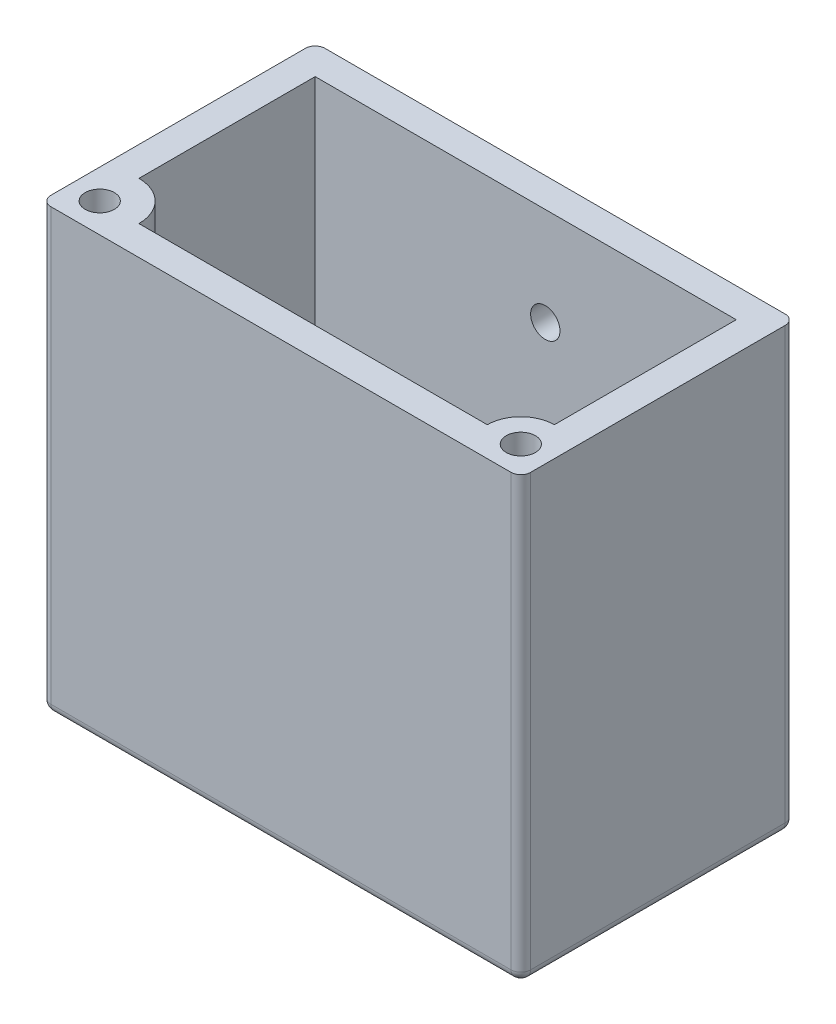
ISO-10303-21;
HEADER;
FILE_DESCRIPTION(('STEP AP214'),'2;1');
FILE_NAME('part.step','',(''),(''),'','','');
FILE_SCHEMA(('AUTOMOTIVE_DESIGN { 1 0 10303 214 1 1 1 1 }'));
ENDSEC;
DATA;
#1=APPLICATION_CONTEXT('core data for automotive mechanical design processes');
#2=APPLICATION_PROTOCOL_DEFINITION('international standard','automotive_design',2000,#1);
#3=PRODUCT_CONTEXT('',#1,'mechanical');
#4=PRODUCT('Part','Part','',(#3));
#5=PRODUCT_RELATED_PRODUCT_CATEGORY('part','',(#4));
#6=PRODUCT_DEFINITION_FORMATION('','',#4);
#7=PRODUCT_DEFINITION_CONTEXT('part definition',#1,'design');
#8=PRODUCT_DEFINITION('design','',#6,#7);
#9=PRODUCT_DEFINITION_SHAPE('','',#8);
#10=(LENGTH_UNIT() NAMED_UNIT(*) SI_UNIT(.MILLI.,.METRE.));
#11=(NAMED_UNIT(*) PLANE_ANGLE_UNIT() SI_UNIT($,.RADIAN.));
#12=(NAMED_UNIT(*) SI_UNIT($,.STERADIAN.) SOLID_ANGLE_UNIT());
#13=UNCERTAINTY_MEASURE_WITH_UNIT(LENGTH_MEASURE(1.E-05),#10,'distance_accuracy_value','');
#14=(GEOMETRIC_REPRESENTATION_CONTEXT(3) GLOBAL_UNCERTAINTY_ASSIGNED_CONTEXT((#13)) GLOBAL_UNIT_ASSIGNED_CONTEXT((#10,
#11,#12)) REPRESENTATION_CONTEXT('',''));
#15=CARTESIAN_POINT('',(0.,0.,0.));
#16=DIRECTION('',(0.,0.,1.));
#17=DIRECTION('',(1.,0.,0.));
#18=AXIS2_PLACEMENT_3D('',#15,#16,#17);
#19=CARTESIAN_POINT('',(-29.4867256637168,45.,-17.2212389380531));
#20=DIRECTION('',(1.,0.,0.));
#21=DIRECTION('',(0.,0.,-1.));
#22=AXIS2_PLACEMENT_3D('',#19,#20,#21);
#23=PLANE('',#22);
#24=DIRECTION('',(0.,0.,1.));
#25=VECTOR('',#24,1.);
#26=CARTESIAN_POINT('',(-29.4867256637168,45.,-17.2212389380531));
#27=LINE('',#26,#25);
#28=CARTESIAN_POINT('',(-29.4867256637168,45.,-16.2212389380531));
#29=VERTEX_POINT('',#28);
#30=CARTESIAN_POINT('',(-29.4867256637168,45.,9.7787610619469));
#31=VERTEX_POINT('',#30);
#32=EDGE_CURVE('E352',#29,#31,#27,.T.);
#33=ORIENTED_EDGE('',*,*,#32,.F.);
#34=DIRECTION('',(0.,-1.,0.));
#35=VECTOR('',#34,1.);
#36=CARTESIAN_POINT('',(-29.4867256637168,45.,-16.2212389380531));
#37=LINE('',#36,#35);
#38=CARTESIAN_POINT('',(-29.4867256637168,1.,-16.2212389380531));
#39=VERTEX_POINT('',#38);
#40=EDGE_CURVE('E237',#29,#39,#37,.T.);
#41=ORIENTED_EDGE('',*,*,#40,.T.);
#42=DIRECTION('',(0.,0.,1.));
#43=VECTOR('',#42,1.);
#44=CARTESIAN_POINT('',(-29.4867256637168,1.,-17.2212389380531));
#45=LINE('',#44,#43);
#46=CARTESIAN_POINT('',(-29.4867256637168,1.,9.77876106194691));
#47=VERTEX_POINT('',#46);
#48=EDGE_CURVE('E235',#39,#47,#45,.T.);
#49=ORIENTED_EDGE('',*,*,#48,.T.);
#50=DIRECTION('',(0.,-1.,0.));
#51=VECTOR('',#50,1.);
#52=CARTESIAN_POINT('',(-29.4867256637168,45.,9.77876106194691));
#53=LINE('',#52,#51);
#54=EDGE_CURVE('E233',#47,#31,#53,.F.);
#55=ORIENTED_EDGE('',*,*,#54,.T.);
#56=EDGE_LOOP('',(#33,#41,#49,#55));
#57=FACE_BOUND('',#56,.T.);
#58=ADVANCED_FACE('F34',(#57),#23,.F.);
#59=CARTESIAN_POINT('',(-29.4867256637168,45.,10.7787610619469));
#60=DIRECTION('',(0.,0.,-1.));
#61=DIRECTION('',(-1.,0.,0.));
#62=AXIS2_PLACEMENT_3D('',#59,#60,#61);
#63=PLANE('',#62);
#64=DIRECTION('',(1.,0.,0.));
#65=VECTOR('',#64,1.);
#66=CARTESIAN_POINT('',(-29.4867256637168,1.,10.7787610619469));
#67=LINE('',#66,#65);
#68=CARTESIAN_POINT('',(-28.4867256637168,1.,10.7787610619469));
#69=VERTEX_POINT('',#68);
#70=CARTESIAN_POINT('',(18.5132743362832,1.,10.7787610619469));
#71=VERTEX_POINT('',#70);
#72=EDGE_CURVE('E50',#69,#71,#67,.T.);
#73=ORIENTED_EDGE('',*,*,#72,.T.);
#74=DIRECTION('',(0.,-1.,0.));
#75=VECTOR('',#74,1.);
#76=CARTESIAN_POINT('',(18.5132743362832,45.,10.7787610619469));
#77=LINE('',#76,#75);
#78=CARTESIAN_POINT('',(18.5132743362832,45.,10.7787610619469));
#79=VERTEX_POINT('',#78);
#80=EDGE_CURVE('E11',#71,#79,#77,.F.);
#81=ORIENTED_EDGE('',*,*,#80,.T.);
#82=DIRECTION('',(1.,0.,0.));
#83=VECTOR('',#82,1.);
#84=CARTESIAN_POINT('',(-29.4867256637168,45.,10.7787610619469));
#85=LINE('',#84,#83);
#86=CARTESIAN_POINT('',(-28.4867256637168,45.,10.7787610619469));
#87=VERTEX_POINT('',#86);
#88=EDGE_CURVE('E357',#87,#79,#85,.T.);
#89=ORIENTED_EDGE('',*,*,#88,.F.);
#90=DIRECTION('',(0.,-1.,0.));
#91=VECTOR('',#90,1.);
#92=CARTESIAN_POINT('',(-28.4867256637168,45.,10.7787610619469));
#93=LINE('',#92,#91);
#94=EDGE_CURVE('E43',#87,#69,#93,.T.);
#95=ORIENTED_EDGE('',*,*,#94,.T.);
#96=EDGE_LOOP('',(#73,#81,#89,#95));
#97=FACE_BOUND('',#96,.T.);
#98=ADVANCED_FACE('F407',(#97),#63,.F.);
#99=CARTESIAN_POINT('',(19.5132743362832,45.,-17.2212389380531));
#100=DIRECTION('',(-1.,0.,0.));
#101=DIRECTION('',(0.,0.,1.));
#102=AXIS2_PLACEMENT_3D('',#99,#100,#101);
#103=PLANE('',#102);
#104=DIRECTION('',(0.,0.,-1.));
#105=VECTOR('',#104,1.);
#106=CARTESIAN_POINT('',(19.5132743362832,1.,-17.2212389380531));
#107=LINE('',#106,#105);
#108=CARTESIAN_POINT('',(19.5132743362832,1.,9.77876106194691));
#109=VERTEX_POINT('',#108);
#110=CARTESIAN_POINT('',(19.5132743362832,1.,-16.2212389380531));
#111=VERTEX_POINT('',#110);
#112=EDGE_CURVE('E199',#109,#111,#107,.T.);
#113=ORIENTED_EDGE('',*,*,#112,.T.);
#114=DIRECTION('',(0.,-1.,0.));
#115=VECTOR('',#114,1.);
#116=CARTESIAN_POINT('',(19.5132743362832,45.,-16.2212389380531));
#117=LINE('',#116,#115);
#118=CARTESIAN_POINT('',(19.5132743362832,45.,-16.2212389380531));
#119=VERTEX_POINT('',#118);
#120=EDGE_CURVE('E208',#111,#119,#117,.F.);
#121=ORIENTED_EDGE('',*,*,#120,.T.);
#122=DIRECTION('',(0.,0.,-1.));
#123=VECTOR('',#122,1.);
#124=CARTESIAN_POINT('',(19.5132743362832,45.,-17.2212389380531));
#125=LINE('',#124,#123);
#126=CARTESIAN_POINT('',(19.5132743362832,45.,9.77876106194691));
#127=VERTEX_POINT('',#126);
#128=EDGE_CURVE('E360',#127,#119,#125,.T.);
#129=ORIENTED_EDGE('',*,*,#128,.F.);
#130=DIRECTION('',(0.,-1.,0.));
#131=VECTOR('',#130,1.);
#132=CARTESIAN_POINT('',(19.5132743362832,45.,9.77876106194691));
#133=LINE('',#132,#131);
#134=EDGE_CURVE('E196',#127,#109,#133,.T.);
#135=ORIENTED_EDGE('',*,*,#134,.T.);
#136=EDGE_LOOP('',(#113,#121,#129,#135));
#137=FACE_BOUND('',#136,.T.);
#138=ADVANCED_FACE('F412',(#137),#103,.F.);
#139=CARTESIAN_POINT('',(-29.4867256637168,45.,-17.2212389380531));
#140=DIRECTION('',(0.,0.,1.));
#141=DIRECTION('',(1.,0.,0.));
#142=AXIS2_PLACEMENT_3D('',#139,#140,#141);
#143=PLANE('',#142);
#144=CARTESIAN_POINT('',(-2.98672566371681,35.,-17.2212389380531));
#145=DIRECTION('',(0.,0.,1.));
#146=DIRECTION('',(1.,0.,0.));
#147=AXIS2_PLACEMENT_3D('',#144,#145,#146);
#148=CIRCLE('',#147,1.5);
#149=CARTESIAN_POINT('',(-1.48672566371681,35.,-17.2212389380531));
#150=VERTEX_POINT('',#149);
#151=EDGE_CURVE('E300',#150,#150,#148,.T.);
#152=ORIENTED_EDGE('',*,*,#151,.T.);
#153=EDGE_LOOP('',(#152));
#154=FACE_BOUND('',#153,.T.);
#155=DIRECTION('',(-1.,0.,0.));
#156=VECTOR('',#155,1.);
#157=CARTESIAN_POINT('',(-29.4867256637168,45.,-17.2212389380531));
#158=LINE('',#157,#156);
#159=CARTESIAN_POINT('',(18.5132743362832,45.,-17.2212389380531));
#160=VERTEX_POINT('',#159);
#161=CARTESIAN_POINT('',(-28.4867256637168,45.,-17.2212389380531));
#162=VERTEX_POINT('',#161);
#163=EDGE_CURVE('E202',#160,#162,#158,.T.);
#164=ORIENTED_EDGE('',*,*,#163,.F.);
#165=DIRECTION('',(0.,-1.,0.));
#166=VECTOR('',#165,1.);
#167=CARTESIAN_POINT('',(18.5132743362832,45.,-17.2212389380531));
#168=LINE('',#167,#166);
#169=CARTESIAN_POINT('',(18.5132743362832,1.,-17.2212389380531));
#170=VERTEX_POINT('',#169);
#171=EDGE_CURVE('E223',#160,#170,#168,.T.);
#172=ORIENTED_EDGE('',*,*,#171,.T.);
#173=DIRECTION('',(-1.,0.,0.));
#174=VECTOR('',#173,1.);
#175=CARTESIAN_POINT('',(-29.4867256637168,1.,-17.2212389380531));
#176=LINE('',#175,#174);
#177=CARTESIAN_POINT('',(-28.4867256637168,1.,-17.2212389380531));
#178=VERTEX_POINT('',#177);
#179=EDGE_CURVE('E221',#170,#178,#176,.T.);
#180=ORIENTED_EDGE('',*,*,#179,.T.);
#181=DIRECTION('',(0.,-1.,0.));
#182=VECTOR('',#181,1.);
#183=CARTESIAN_POINT('',(-28.4867256637168,45.,-17.2212389380531));
#184=LINE('',#183,#182);
#185=EDGE_CURVE('E219',#178,#162,#184,.F.);
#186=ORIENTED_EDGE('',*,*,#185,.T.);
#187=EDGE_LOOP('',(#164,#172,#180,#186));
#188=FACE_BOUND('',#187,.T.);
#189=ADVANCED_FACE('F537',(#154,#188),#143,.F.);
#190=CARTESIAN_POINT('',(0.,45.,0.));
#191=DIRECTION('',(0.,1.,0.));
#192=DIRECTION('',(0.,0.,1.));
#193=AXIS2_PLACEMENT_3D('',#190,#191,#192);
#194=PLANE('',#193);
#195=CARTESIAN_POINT('',(-26.4867256637168,45.,7.77876106194691));
#196=DIRECTION('',(0.,-1.,0.));
#197=DIRECTION('',(0.,0.,-1.));
#198=AXIS2_PLACEMENT_3D('',#195,#196,#197);
#199=CIRCLE('',#198,1.49);
#200=CARTESIAN_POINT('',(-26.4867256637168,45.,6.28876106194691));
#201=VERTEX_POINT('',#200);
#202=EDGE_CURVE('E276',#201,#201,#199,.T.);
#203=ORIENTED_EDGE('',*,*,#202,.T.);
#204=EDGE_LOOP('',(#203));
#205=FACE_BOUND('',#204,.T.);
#206=DIRECTION('',(1.,0.,0.));
#207=VECTOR('',#206,1.);
#208=CARTESIAN_POINT('',(16.5132743362832,45.,7.77876106194691));
#209=LINE('',#208,#207);
#210=CARTESIAN_POINT('',(-22.4867256637168,45.,7.77876106194691));
#211=VERTEX_POINT('',#210);
#212=CARTESIAN_POINT('',(13.0915061708648,45.,7.77876106194691));
#213=VERTEX_POINT('',#212);
#214=EDGE_CURVE('E340',#211,#213,#209,.T.);
#215=ORIENTED_EDGE('',*,*,#214,.F.);
#216=CARTESIAN_POINT('',(-26.4867256637168,45.,7.77876106194691));
#217=DIRECTION('',(0.,-1.,0.));
#218=DIRECTION('',(0.,0.,-1.));
#219=AXIS2_PLACEMENT_3D('',#216,#217,#218);
#220=CIRCLE('',#219,4.);
#221=CARTESIAN_POINT('',(-26.4867256637168,45.,3.77876106194691));
#222=VERTEX_POINT('',#221);
#223=EDGE_CURVE('E192',#222,#211,#220,.T.);
#224=ORIENTED_EDGE('',*,*,#223,.F.);
#225=DIRECTION('',(0.,0.,1.));
#226=VECTOR('',#225,1.);
#227=CARTESIAN_POINT('',(-26.4867256637168,45.,7.77876106194691));
#228=LINE('',#227,#226);
#229=CARTESIAN_POINT('',(-26.4867256637168,45.,-14.2212389380531));
#230=VERTEX_POINT('',#229);
#231=EDGE_CURVE('E187',#230,#222,#228,.T.);
#232=ORIENTED_EDGE('',*,*,#231,.F.);
#233=DIRECTION('',(-1.,0.,0.));
#234=VECTOR('',#233,1.);
#235=CARTESIAN_POINT('',(16.5132743362832,45.,-14.2212389380531));
#236=LINE('',#235,#234);
#237=CARTESIAN_POINT('',(16.5132743362832,45.,-14.2212389380531));
#238=VERTEX_POINT('',#237);
#239=EDGE_CURVE('E345',#238,#230,#236,.T.);
#240=ORIENTED_EDGE('',*,*,#239,.F.);
#241=DIRECTION('',(0.,0.,-1.));
#242=VECTOR('',#241,1.);
#243=CARTESIAN_POINT('',(16.5132743362832,45.,7.77876106194691));
#244=LINE('',#243,#242);
#245=CARTESIAN_POINT('',(16.5132743362832,45.,4.35699289652851));
#246=VERTEX_POINT('',#245);
#247=EDGE_CURVE('E337',#246,#238,#244,.T.);
#248=ORIENTED_EDGE('',*,*,#247,.F.);
#249=CARTESIAN_POINT('',(16.5132743362832,45.,7.77876106194691));
#250=DIRECTION('',(0.,-1.,0.));
#251=DIRECTION('',(0.,0.,-1.));
#252=AXIS2_PLACEMENT_3D('',#249,#250,#251);
#253=CIRCLE('',#252,3.4217681654184);
#254=EDGE_CURVE('E289',#213,#246,#253,.T.);
#255=ORIENTED_EDGE('',*,*,#254,.F.);
#256=EDGE_LOOP('',(#215,#224,#232,#240,#248,#255));
#257=FACE_BOUND('',#256,.T.);
#258=ORIENTED_EDGE('',*,*,#128,.T.);
#259=CARTESIAN_POINT('',(18.5132743362832,45.,-16.2212389380531));
#260=DIRECTION('',(0.,1.,0.));
#261=DIRECTION('',(0.,0.,1.));
#262=AXIS2_PLACEMENT_3D('',#259,#260,#261);
#263=CIRCLE('',#262,1.);
#264=EDGE_CURVE('E231',#119,#160,#263,.T.);
#265=ORIENTED_EDGE('',*,*,#264,.T.);
#266=ORIENTED_EDGE('',*,*,#163,.T.);
#267=CARTESIAN_POINT('',(-28.4867256637168,45.,-16.2212389380531));
#268=DIRECTION('',(0.,1.,0.));
#269=DIRECTION('',(0.,0.,1.));
#270=AXIS2_PLACEMENT_3D('',#267,#268,#269);
#271=CIRCLE('',#270,1.);
#272=EDGE_CURVE('E229',#162,#29,#271,.T.);
#273=ORIENTED_EDGE('',*,*,#272,.T.);
#274=ORIENTED_EDGE('',*,*,#32,.T.);
#275=CARTESIAN_POINT('',(-28.4867256637168,45.,9.77876106194691));
#276=DIRECTION('',(0.,1.,0.));
#277=DIRECTION('',(0.,0.,1.));
#278=AXIS2_PLACEMENT_3D('',#275,#276,#277);
#279=CIRCLE('',#278,1.);
#280=EDGE_CURVE('E225',#31,#87,#279,.T.);
#281=ORIENTED_EDGE('',*,*,#280,.T.);
#282=ORIENTED_EDGE('',*,*,#88,.T.);
#283=CARTESIAN_POINT('',(18.5132743362832,45.,9.77876106194691));
#284=DIRECTION('',(0.,1.,0.));
#285=DIRECTION('',(0.,0.,1.));
#286=AXIS2_PLACEMENT_3D('',#283,#284,#285);
#287=CIRCLE('',#286,1.);
#288=EDGE_CURVE('E227',#79,#127,#287,.T.);
#289=ORIENTED_EDGE('',*,*,#288,.T.);
#290=EDGE_LOOP('',(#258,#265,#266,#273,#274,#281,#282,#289));
#291=FACE_BOUND('',#290,.T.);
#292=CARTESIAN_POINT('',(16.5132743362832,45.,7.77876106194691));
#293=DIRECTION('',(0.,-1.,0.));
#294=DIRECTION('',(0.,0.,-1.));
#295=AXIS2_PLACEMENT_3D('',#292,#293,#294);
#296=CIRCLE('',#295,1.49);
#297=CARTESIAN_POINT('',(16.5132743362832,45.,6.28876106194691));
#298=VERTEX_POINT('',#297);
#299=EDGE_CURVE('E286',#298,#298,#296,.T.);
#300=ORIENTED_EDGE('',*,*,#299,.T.);
#301=EDGE_LOOP('',(#300));
#302=FACE_BOUND('',#301,.T.);
#303=ADVANCED_FACE('F366',(#205,#257,#291,#302),#194,.T.);
#304=CARTESIAN_POINT('',(0.,0.,0.));
#305=DIRECTION('',(0.,1.,0.));
#306=DIRECTION('',(0.,0.,1.));
#307=AXIS2_PLACEMENT_3D('',#304,#305,#306);
#308=PLANE('',#307);
#309=DIRECTION('',(-1.,0.,0.));
#310=VECTOR('',#309,1.);
#311=CARTESIAN_POINT('',(0.,0.,-16.2212389380531));
#312=LINE('',#311,#310);
#313=CARTESIAN_POINT('',(-28.4867256637168,0.,-16.2212389380531));
#314=VERTEX_POINT('',#313);
#315=CARTESIAN_POINT('',(18.5132743362832,0.,-16.2212389380531));
#316=VERTEX_POINT('',#315);
#317=EDGE_CURVE('E214',#314,#316,#312,.F.);
#318=ORIENTED_EDGE('',*,*,#317,.T.);
#319=DIRECTION('',(0.,0.,-1.));
#320=VECTOR('',#319,1.);
#321=CARTESIAN_POINT('',(18.5132743362832,0.,0.));
#322=LINE('',#321,#320);
#323=CARTESIAN_POINT('',(18.5132743362832,0.,9.77876106194691));
#324=VERTEX_POINT('',#323);
#325=EDGE_CURVE('E216',#316,#324,#322,.F.);
#326=ORIENTED_EDGE('',*,*,#325,.T.);
#327=DIRECTION('',(1.,0.,0.));
#328=VECTOR('',#327,1.);
#329=CARTESIAN_POINT('',(0.,0.,9.77876106194691));
#330=LINE('',#329,#328);
#331=CARTESIAN_POINT('',(-28.4867256637168,0.,9.77876106194691));
#332=VERTEX_POINT('',#331);
#333=EDGE_CURVE('E210',#324,#332,#330,.F.);
#334=ORIENTED_EDGE('',*,*,#333,.T.);
#335=DIRECTION('',(0.,0.,1.));
#336=VECTOR('',#335,1.);
#337=CARTESIAN_POINT('',(-28.4867256637168,0.,0.));
#338=LINE('',#337,#336);
#339=EDGE_CURVE('E212',#332,#314,#338,.F.);
#340=ORIENTED_EDGE('',*,*,#339,.T.);
#341=EDGE_LOOP('',(#318,#326,#334,#340));
#342=FACE_BOUND('',#341,.T.);
#343=CARTESIAN_POINT('',(-26.4867256637168,0.,7.77876106194691));
#344=DIRECTION('',(0.,-1.,0.));
#345=DIRECTION('',(0.,0.,-1.));
#346=AXIS2_PLACEMENT_3D('',#343,#344,#345);
#347=CIRCLE('',#346,1.49);
#348=CARTESIAN_POINT('',(-26.4867256637168,0.,6.28876106194691));
#349=VERTEX_POINT('',#348);
#350=EDGE_CURVE('E273',#349,#349,#347,.T.);
#351=ORIENTED_EDGE('',*,*,#350,.F.);
#352=EDGE_LOOP('',(#351));
#353=FACE_BOUND('',#352,.T.);
#354=CARTESIAN_POINT('',(16.5132743362832,0.,7.77876106194691));
#355=DIRECTION('',(0.,-1.,0.));
#356=DIRECTION('',(0.,0.,-1.));
#357=AXIS2_PLACEMENT_3D('',#354,#355,#356);
#358=CIRCLE('',#357,1.49);
#359=CARTESIAN_POINT('',(16.5132743362832,0.,6.28876106194691));
#360=VERTEX_POINT('',#359);
#361=EDGE_CURVE('E285',#360,#360,#358,.T.);
#362=ORIENTED_EDGE('',*,*,#361,.F.);
#363=EDGE_LOOP('',(#362));
#364=FACE_BOUND('',#363,.T.);
#365=DIRECTION('',(1.,0.,0.));
#366=VECTOR('',#365,1.);
#367=CARTESIAN_POINT('',(0.,0.,-3.22123893805309));
#368=LINE('',#367,#366);
#369=CARTESIAN_POINT('',(-19.4867256637168,0.,-3.22123893805309));
#370=VERTEX_POINT('',#369);
#371=CARTESIAN_POINT('',(9.51327433628319,0.,-3.22123893805309));
#372=VERTEX_POINT('',#371);
#373=EDGE_CURVE('E331',#370,#372,#368,.T.);
#374=ORIENTED_EDGE('',*,*,#373,.T.);
#375=DIRECTION('',(0.,0.,-1.));
#376=VECTOR('',#375,1.);
#377=CARTESIAN_POINT('',(9.51327433628319,0.,0.));
#378=LINE('',#377,#376);
#379=CARTESIAN_POINT('',(9.51327433628319,0.,-11.2212389380531));
#380=VERTEX_POINT('',#379);
#381=EDGE_CURVE('E334',#372,#380,#378,.T.);
#382=ORIENTED_EDGE('',*,*,#381,.T.);
#383=DIRECTION('',(-1.,0.,0.));
#384=VECTOR('',#383,1.);
#385=CARTESIAN_POINT('',(0.,0.,-11.2212389380531));
#386=LINE('',#385,#384);
#387=CARTESIAN_POINT('',(-19.4867256637168,0.,-11.2212389380531));
#388=VERTEX_POINT('',#387);
#389=EDGE_CURVE('E319',#380,#388,#386,.T.);
#390=ORIENTED_EDGE('',*,*,#389,.T.);
#391=DIRECTION('',(0.,0.,1.));
#392=VECTOR('',#391,1.);
#393=CARTESIAN_POINT('',(-19.4867256637168,0.,0.));
#394=LINE('',#393,#392);
#395=EDGE_CURVE('E328',#388,#370,#394,.T.);
#396=ORIENTED_EDGE('',*,*,#395,.T.);
#397=EDGE_LOOP('',(#374,#382,#390,#396));
#398=FACE_BOUND('',#397,.T.);
#399=ADVANCED_FACE('F386',(#342,#353,#364,#398),#308,.F.);
#400=CARTESIAN_POINT('',(16.5132743362832,2.,7.77876106194691));
#401=DIRECTION('',(1.,0.,0.));
#402=DIRECTION('',(0.,0.,-1.));
#403=AXIS2_PLACEMENT_3D('',#400,#401,#402);
#404=PLANE('',#403);
#405=DIRECTION('',(0.,0.,-1.));
#406=VECTOR('',#405,1.);
#407=CARTESIAN_POINT('',(16.5132743362832,2.,7.77876106194691));
#408=LINE('',#407,#406);
#409=CARTESIAN_POINT('',(16.5132743362832,2.,4.35699289652851));
#410=VERTEX_POINT('',#409);
#411=CARTESIAN_POINT('',(16.5132743362832,2.,-14.2212389380531));
#412=VERTEX_POINT('',#411);
#413=EDGE_CURVE('E338',#410,#412,#408,.T.);
#414=ORIENTED_EDGE('',*,*,#413,.F.);
#415=DIRECTION('',(0.,-1.,0.));
#416=VECTOR('',#415,1.);
#417=CARTESIAN_POINT('',(16.5132743362832,45.,4.35699289652851));
#418=LINE('',#417,#416);
#419=EDGE_CURVE('E297',#410,#246,#418,.F.);
#420=ORIENTED_EDGE('',*,*,#419,.T.);
#421=ORIENTED_EDGE('',*,*,#247,.T.);
#422=DIRECTION('',(0.,1.,0.));
#423=VECTOR('',#422,1.);
#424=CARTESIAN_POINT('',(16.5132743362832,2.,-14.2212389380531));
#425=LINE('',#424,#423);
#426=EDGE_CURVE('E343',#412,#238,#425,.T.);
#427=ORIENTED_EDGE('',*,*,#426,.F.);
#428=EDGE_LOOP('',(#414,#420,#421,#427));
#429=FACE_BOUND('',#428,.T.);
#430=ADVANCED_FACE('F567',(#429),#404,.F.);
#431=CARTESIAN_POINT('',(16.5132743362832,2.,7.77876106194691));
#432=DIRECTION('',(0.,0.,1.));
#433=DIRECTION('',(1.,0.,0.));
#434=AXIS2_PLACEMENT_3D('',#431,#432,#433);
#435=PLANE('',#434);
#436=DIRECTION('',(1.,0.,0.));
#437=VECTOR('',#436,1.);
#438=CARTESIAN_POINT('',(16.5132743362832,2.,7.77876106194691));
#439=LINE('',#438,#437);
#440=CARTESIAN_POINT('',(-22.4867256637168,2.,7.77876106194691));
#441=VERTEX_POINT('',#440);
#442=CARTESIAN_POINT('',(13.0915061708648,2.,7.77876106194691));
#443=VERTEX_POINT('',#442);
#444=EDGE_CURVE('E181',#441,#443,#439,.T.);
#445=ORIENTED_EDGE('',*,*,#444,.F.);
#446=DIRECTION('',(0.,-1.,0.));
#447=VECTOR('',#446,1.);
#448=CARTESIAN_POINT('',(-22.4867256637168,45.,7.77876106194691));
#449=LINE('',#448,#447);
#450=EDGE_CURVE('E191',#441,#211,#449,.F.);
#451=ORIENTED_EDGE('',*,*,#450,.T.);
#452=ORIENTED_EDGE('',*,*,#214,.T.);
#453=DIRECTION('',(0.,-1.,0.));
#454=VECTOR('',#453,1.);
#455=CARTESIAN_POINT('',(13.0915061708648,45.,7.77876106194691));
#456=LINE('',#455,#454);
#457=EDGE_CURVE('E294',#213,#443,#456,.T.);
#458=ORIENTED_EDGE('',*,*,#457,.T.);
#459=EDGE_LOOP('',(#445,#451,#452,#458));
#460=FACE_BOUND('',#459,.T.);
#461=ADVANCED_FACE('F572',(#460),#435,.F.);
#462=CARTESIAN_POINT('',(-26.4867256637168,2.,7.77876106194691));
#463=DIRECTION('',(-1.,0.,0.));
#464=DIRECTION('',(0.,0.,1.));
#465=AXIS2_PLACEMENT_3D('',#462,#463,#464);
#466=PLANE('',#465);
#467=ORIENTED_EDGE('',*,*,#231,.T.);
#468=DIRECTION('',(0.,-1.,0.));
#469=VECTOR('',#468,1.);
#470=CARTESIAN_POINT('',(-26.4867256637168,45.,3.77876106194691));
#471=LINE('',#470,#469);
#472=CARTESIAN_POINT('',(-26.4867256637168,2.,3.77876106194691));
#473=VERTEX_POINT('',#472);
#474=EDGE_CURVE('E184',#222,#473,#471,.T.);
#475=ORIENTED_EDGE('',*,*,#474,.T.);
#476=DIRECTION('',(0.,0.,1.));
#477=VECTOR('',#476,1.);
#478=CARTESIAN_POINT('',(-26.4867256637168,2.,7.77876106194691));
#479=LINE('',#478,#477);
#480=CARTESIAN_POINT('',(-26.4867256637168,2.,-14.2212389380531));
#481=VERTEX_POINT('',#480);
#482=EDGE_CURVE('E171',#481,#473,#479,.T.);
#483=ORIENTED_EDGE('',*,*,#482,.F.);
#484=DIRECTION('',(0.,1.,0.));
#485=VECTOR('',#484,1.);
#486=CARTESIAN_POINT('',(-26.4867256637168,2.,-14.2212389380531));
#487=LINE('',#486,#485);
#488=EDGE_CURVE('E350',#481,#230,#487,.T.);
#489=ORIENTED_EDGE('',*,*,#488,.T.);
#490=EDGE_LOOP('',(#467,#475,#483,#489));
#491=FACE_BOUND('',#490,.T.);
#492=ADVANCED_FACE('F185',(#491),#466,.F.);
#493=CARTESIAN_POINT('',(16.5132743362832,2.,-14.2212389380531));
#494=DIRECTION('',(0.,0.,-1.));
#495=DIRECTION('',(-1.,0.,0.));
#496=AXIS2_PLACEMENT_3D('',#493,#494,#495);
#497=PLANE('',#496);
#498=CARTESIAN_POINT('',(-2.98672566371681,35.,-14.2212389380531));
#499=DIRECTION('',(0.,0.,1.));
#500=DIRECTION('',(1.,0.,0.));
#501=AXIS2_PLACEMENT_3D('',#498,#499,#500);
#502=CIRCLE('',#501,1.5);
#503=CARTESIAN_POINT('',(-1.48672566371681,35.,-14.2212389380531));
#504=VERTEX_POINT('',#503);
#505=EDGE_CURVE('E299',#504,#504,#502,.T.);
#506=ORIENTED_EDGE('',*,*,#505,.F.);
#507=EDGE_LOOP('',(#506));
#508=FACE_BOUND('',#507,.T.);
#509=ORIENTED_EDGE('',*,*,#239,.T.);
#510=ORIENTED_EDGE('',*,*,#488,.F.);
#511=DIRECTION('',(-1.,0.,0.));
#512=VECTOR('',#511,1.);
#513=CARTESIAN_POINT('',(16.5132743362832,2.,-14.2212389380531));
#514=LINE('',#513,#512);
#515=EDGE_CURVE('E179',#412,#481,#514,.T.);
#516=ORIENTED_EDGE('',*,*,#515,.F.);
#517=ORIENTED_EDGE('',*,*,#426,.T.);
#518=EDGE_LOOP('',(#509,#510,#516,#517));
#519=FACE_BOUND('',#518,.T.);
#520=ADVANCED_FACE('F592',(#508,#519),#497,.F.);
#521=CARTESIAN_POINT('',(0.,2.,0.));
#522=DIRECTION('',(0.,1.,0.));
#523=DIRECTION('',(0.,0.,1.));
#524=AXIS2_PLACEMENT_3D('',#521,#522,#523);
#525=PLANE('',#524);
#526=CARTESIAN_POINT('',(-26.4867256637168,2.,7.77876106194691));
#527=DIRECTION('',(0.,1.,0.));
#528=DIRECTION('',(0.,0.,1.));
#529=AXIS2_PLACEMENT_3D('',#526,#527,#528);
#530=CIRCLE('',#529,4.);
#531=EDGE_CURVE('E176',#441,#473,#530,.T.);
#532=ORIENTED_EDGE('',*,*,#531,.F.);
#533=ORIENTED_EDGE('',*,*,#444,.T.);
#534=CARTESIAN_POINT('',(16.5132743362832,2.,7.77876106194691));
#535=DIRECTION('',(0.,1.,0.));
#536=DIRECTION('',(0.,0.,1.));
#537=AXIS2_PLACEMENT_3D('',#534,#535,#536);
#538=CIRCLE('',#537,3.4217681654184);
#539=EDGE_CURVE('E197',#410,#443,#538,.T.);
#540=ORIENTED_EDGE('',*,*,#539,.F.);
#541=ORIENTED_EDGE('',*,*,#413,.T.);
#542=ORIENTED_EDGE('',*,*,#515,.T.);
#543=ORIENTED_EDGE('',*,*,#482,.T.);
#544=EDGE_LOOP('',(#532,#533,#540,#541,#542,#543));
#545=FACE_BOUND('',#544,.T.);
#546=DIRECTION('',(0.,0.,-1.));
#547=VECTOR('',#546,1.);
#548=CARTESIAN_POINT('',(9.51327433628319,2.,-3.22123893805309));
#549=LINE('',#548,#547);
#550=CARTESIAN_POINT('',(9.51327433628319,2.,-3.22123893805309));
#551=VERTEX_POINT('',#550);
#552=CARTESIAN_POINT('',(9.51327433628319,2.,-11.2212389380531));
#553=VERTEX_POINT('',#552);
#554=EDGE_CURVE('E303',#551,#553,#549,.T.);
#555=ORIENTED_EDGE('',*,*,#554,.F.);
#556=DIRECTION('',(1.,0.,0.));
#557=VECTOR('',#556,1.);
#558=CARTESIAN_POINT('',(9.51327433628319,2.,-3.22123893805309));
#559=LINE('',#558,#557);
#560=CARTESIAN_POINT('',(-19.4867256637168,2.,-3.22123893805309));
#561=VERTEX_POINT('',#560);
#562=EDGE_CURVE('E313',#561,#551,#559,.T.);
#563=ORIENTED_EDGE('',*,*,#562,.F.);
#564=DIRECTION('',(0.,0.,1.));
#565=VECTOR('',#564,1.);
#566=CARTESIAN_POINT('',(-19.4867256637168,2.,-3.22123893805309));
#567=LINE('',#566,#565);
#568=CARTESIAN_POINT('',(-19.4867256637168,2.,-11.2212389380531));
#569=VERTEX_POINT('',#568);
#570=EDGE_CURVE('E310',#569,#561,#567,.T.);
#571=ORIENTED_EDGE('',*,*,#570,.F.);
#572=DIRECTION('',(-1.,0.,0.));
#573=VECTOR('',#572,1.);
#574=CARTESIAN_POINT('',(9.51327433628319,2.,-11.2212389380531));
#575=LINE('',#574,#573);
#576=EDGE_CURVE('E307',#553,#569,#575,.T.);
#577=ORIENTED_EDGE('',*,*,#576,.F.);
#578=EDGE_LOOP('',(#555,#563,#571,#577));
#579=FACE_BOUND('',#578,.T.);
#580=ADVANCED_FACE('F173',(#545,#579),#525,.T.);
#581=CARTESIAN_POINT('',(9.51327433628319,-0.999999999999998,-3.22123893805309));
#582=DIRECTION('',(1.,0.,0.));
#583=DIRECTION('',(0.,0.,-1.));
#584=AXIS2_PLACEMENT_3D('',#581,#582,#583);
#585=PLANE('',#584);
#586=DIRECTION('',(0.,1.,0.));
#587=VECTOR('',#586,1.);
#588=CARTESIAN_POINT('',(9.51327433628319,-0.999999999999998,-3.22123893805309));
#589=LINE('',#588,#587);
#590=EDGE_CURVE('E317',#372,#551,#589,.T.);
#591=ORIENTED_EDGE('',*,*,#590,.T.);
#592=ORIENTED_EDGE('',*,*,#554,.T.);
#593=DIRECTION('',(0.,1.,0.));
#594=VECTOR('',#593,1.);
#595=CARTESIAN_POINT('',(9.51327433628319,-0.999999999999998,-11.2212389380531));
#596=LINE('',#595,#594);
#597=EDGE_CURVE('E316',#380,#553,#596,.T.);
#598=ORIENTED_EDGE('',*,*,#597,.F.);
#599=ORIENTED_EDGE('',*,*,#381,.F.);
#600=EDGE_LOOP('',(#591,#592,#598,#599));
#601=FACE_BOUND('',#600,.T.);
#602=ADVANCED_FACE('F628',(#601),#585,.F.);
#603=CARTESIAN_POINT('',(9.51327433628319,-0.999999999999998,-3.22123893805309));
#604=DIRECTION('',(0.,0.,1.));
#605=DIRECTION('',(1.,0.,0.));
#606=AXIS2_PLACEMENT_3D('',#603,#604,#605);
#607=PLANE('',#606);
#608=DIRECTION('',(0.,1.,0.));
#609=VECTOR('',#608,1.);
#610=CARTESIAN_POINT('',(-19.4867256637168,-0.999999999999998,-3.22123893805309));
#611=LINE('',#610,#609);
#612=EDGE_CURVE('E320',#370,#561,#611,.T.);
#613=ORIENTED_EDGE('',*,*,#612,.T.);
#614=ORIENTED_EDGE('',*,*,#562,.T.);
#615=ORIENTED_EDGE('',*,*,#590,.F.);
#616=ORIENTED_EDGE('',*,*,#373,.F.);
#617=EDGE_LOOP('',(#613,#614,#615,#616));
#618=FACE_BOUND('',#617,.T.);
#619=ADVANCED_FACE('F618',(#618),#607,.F.);
#620=CARTESIAN_POINT('',(-19.4867256637168,-0.999999999999998,-3.22123893805309));
#621=DIRECTION('',(-1.,0.,0.));
#622=DIRECTION('',(0.,0.,1.));
#623=AXIS2_PLACEMENT_3D('',#620,#621,#622);
#624=PLANE('',#623);
#625=DIRECTION('',(0.,1.,0.));
#626=VECTOR('',#625,1.);
#627=CARTESIAN_POINT('',(-19.4867256637168,-0.999999999999998,-11.2212389380531));
#628=LINE('',#627,#626);
#629=EDGE_CURVE('E322',#388,#569,#628,.T.);
#630=ORIENTED_EDGE('',*,*,#629,.T.);
#631=ORIENTED_EDGE('',*,*,#570,.T.);
#632=ORIENTED_EDGE('',*,*,#612,.F.);
#633=ORIENTED_EDGE('',*,*,#395,.F.);
#634=EDGE_LOOP('',(#630,#631,#632,#633));
#635=FACE_BOUND('',#634,.T.);
#636=ADVANCED_FACE('F608',(#635),#624,.F.);
#637=CARTESIAN_POINT('',(9.51327433628319,-0.999999999999998,-11.2212389380531));
#638=DIRECTION('',(0.,0.,-1.));
#639=DIRECTION('',(-1.,0.,0.));
#640=AXIS2_PLACEMENT_3D('',#637,#638,#639);
#641=PLANE('',#640);
#642=ORIENTED_EDGE('',*,*,#597,.T.);
#643=ORIENTED_EDGE('',*,*,#576,.T.);
#644=ORIENTED_EDGE('',*,*,#629,.F.);
#645=ORIENTED_EDGE('',*,*,#389,.F.);
#646=EDGE_LOOP('',(#642,#643,#644,#645));
#647=FACE_BOUND('',#646,.T.);
#648=ADVANCED_FACE('F584',(#647),#641,.F.);
#649=CARTESIAN_POINT('',(-2.98672566371681,35.,-17.2212389380531));
#650=DIRECTION('',(0.,0.,1.));
#651=DIRECTION('',(1.,0.,0.));
#652=AXIS2_PLACEMENT_3D('',#649,#650,#651);
#653=CYLINDRICAL_SURFACE('',#652,1.5);
#654=ORIENTED_EDGE('',*,*,#151,.F.);
#655=EDGE_LOOP('',(#654));
#656=FACE_BOUND('',#655,.T.);
#657=ORIENTED_EDGE('',*,*,#505,.T.);
#658=EDGE_LOOP('',(#657));
#659=FACE_BOUND('',#658,.T.);
#660=ADVANCED_FACE('F560',(#656,#659),#653,.F.);
#661=CARTESIAN_POINT('',(16.5132743362832,45.,7.77876106194691));
#662=DIRECTION('',(0.,-1.,0.));
#663=DIRECTION('',(0.,0.,-1.));
#664=AXIS2_PLACEMENT_3D('',#661,#662,#663);
#665=CYLINDRICAL_SURFACE('',#664,3.4217681654184);
#666=ORIENTED_EDGE('',*,*,#419,.F.);
#667=ORIENTED_EDGE('',*,*,#539,.T.);
#668=ORIENTED_EDGE('',*,*,#457,.F.);
#669=ORIENTED_EDGE('',*,*,#254,.T.);
#670=EDGE_LOOP('',(#666,#667,#668,#669));
#671=FACE_BOUND('',#670,.T.);
#672=ADVANCED_FACE('F551',(#671),#665,.T.);
#673=CARTESIAN_POINT('',(16.5132743362832,45.,7.77876106194691));
#674=DIRECTION('',(0.,-1.,0.));
#675=DIRECTION('',(0.,0.,-1.));
#676=AXIS2_PLACEMENT_3D('',#673,#674,#675);
#677=CYLINDRICAL_SURFACE('',#676,1.49);
#678=ORIENTED_EDGE('',*,*,#299,.F.);
#679=EDGE_LOOP('',(#678));
#680=FACE_BOUND('',#679,.T.);
#681=ORIENTED_EDGE('',*,*,#361,.T.);
#682=EDGE_LOOP('',(#681));
#683=FACE_BOUND('',#682,.T.);
#684=ADVANCED_FACE('F527',(#680,#683),#677,.F.);
#685=CARTESIAN_POINT('',(-26.4867256637168,45.,7.77876106194691));
#686=DIRECTION('',(0.,-1.,0.));
#687=DIRECTION('',(0.,0.,-1.));
#688=AXIS2_PLACEMENT_3D('',#685,#686,#687);
#689=CYLINDRICAL_SURFACE('',#688,4.);
#690=ORIENTED_EDGE('',*,*,#450,.F.);
#691=ORIENTED_EDGE('',*,*,#531,.T.);
#692=ORIENTED_EDGE('',*,*,#474,.F.);
#693=ORIENTED_EDGE('',*,*,#223,.T.);
#694=EDGE_LOOP('',(#690,#691,#692,#693));
#695=FACE_BOUND('',#694,.T.);
#696=ADVANCED_FACE('F195',(#695),#689,.T.);
#697=CARTESIAN_POINT('',(-26.4867256637168,45.,7.77876106194691));
#698=DIRECTION('',(0.,-1.,0.));
#699=DIRECTION('',(0.,0.,-1.));
#700=AXIS2_PLACEMENT_3D('',#697,#698,#699);
#701=CYLINDRICAL_SURFACE('',#700,1.49);
#702=ORIENTED_EDGE('',*,*,#202,.F.);
#703=EDGE_LOOP('',(#702));
#704=FACE_BOUND('',#703,.T.);
#705=ORIENTED_EDGE('',*,*,#350,.T.);
#706=EDGE_LOOP('',(#705));
#707=FACE_BOUND('',#706,.T.);
#708=ADVANCED_FACE('F510',(#704,#707),#701,.F.);
#709=CARTESIAN_POINT('',(-28.4867256637168,45.,9.77876106194691));
#710=DIRECTION('',(0.,-1.,0.));
#711=DIRECTION('',(0.,0.,-1.));
#712=AXIS2_PLACEMENT_3D('',#709,#710,#711);
#713=CYLINDRICAL_SURFACE('',#712,1.);
#714=ORIENTED_EDGE('',*,*,#280,.F.);
#715=ORIENTED_EDGE('',*,*,#54,.F.);
#716=CARTESIAN_POINT('',(-28.4867256637168,1.,9.77876106194691));
#717=DIRECTION('',(0.,-1.,0.));
#718=DIRECTION('',(0.,0.,-1.));
#719=AXIS2_PLACEMENT_3D('',#716,#717,#718);
#720=CIRCLE('',#719,1.);
#721=EDGE_CURVE('E268',#69,#47,#720,.T.);
#722=ORIENTED_EDGE('',*,*,#721,.F.);
#723=ORIENTED_EDGE('',*,*,#94,.F.);
#724=EDGE_LOOP('',(#714,#715,#722,#723));
#725=FACE_BOUND('',#724,.T.);
#726=ADVANCED_FACE('F36',(#725),#713,.T.);
#727=CARTESIAN_POINT('',(-28.4867256637168,45.,-16.2212389380531));
#728=DIRECTION('',(0.,-1.,0.));
#729=DIRECTION('',(0.,0.,-1.));
#730=AXIS2_PLACEMENT_3D('',#727,#728,#729);
#731=CYLINDRICAL_SURFACE('',#730,1.);
#732=ORIENTED_EDGE('',*,*,#272,.F.);
#733=ORIENTED_EDGE('',*,*,#185,.F.);
#734=CARTESIAN_POINT('',(-28.4867256637168,1.,-16.2212389380531));
#735=DIRECTION('',(0.,-1.,0.));
#736=DIRECTION('',(0.,0.,-1.));
#737=AXIS2_PLACEMENT_3D('',#734,#735,#736);
#738=CIRCLE('',#737,1.);
#739=EDGE_CURVE('E266',#39,#178,#738,.T.);
#740=ORIENTED_EDGE('',*,*,#739,.F.);
#741=ORIENTED_EDGE('',*,*,#40,.F.);
#742=EDGE_LOOP('',(#732,#733,#740,#741));
#743=FACE_BOUND('',#742,.T.);
#744=ADVANCED_FACE('F375',(#743),#731,.T.);
#745=CARTESIAN_POINT('',(-28.4867256637168,1.,-17.2212389380531));
#746=DIRECTION('',(0.,0.,1.));
#747=DIRECTION('',(1.,0.,0.));
#748=AXIS2_PLACEMENT_3D('',#745,#746,#747);
#749=CYLINDRICAL_SURFACE('',#748,1.);
#750=CARTESIAN_POINT('',(-28.4867256637168,1.,9.77876106194691));
#751=DIRECTION('',(0.,0.,1.));
#752=DIRECTION('',(1.,0.,0.));
#753=AXIS2_PLACEMENT_3D('',#750,#751,#752);
#754=CIRCLE('',#753,1.);
#755=EDGE_CURVE('E38',#47,#332,#754,.T.);
#756=ORIENTED_EDGE('',*,*,#755,.F.);
#757=ORIENTED_EDGE('',*,*,#48,.F.);
#758=CARTESIAN_POINT('',(-28.4867256637168,1.,-16.2212389380531));
#759=DIRECTION('',(0.,0.,-1.));
#760=DIRECTION('',(-1.,0.,0.));
#761=AXIS2_PLACEMENT_3D('',#758,#759,#760);
#762=CIRCLE('',#761,1.);
#763=EDGE_CURVE('E263',#314,#39,#762,.T.);
#764=ORIENTED_EDGE('',*,*,#763,.F.);
#765=ORIENTED_EDGE('',*,*,#339,.F.);
#766=EDGE_LOOP('',(#756,#757,#764,#765));
#767=FACE_BOUND('',#766,.T.);
#768=ADVANCED_FACE('F382',(#767),#749,.T.);
#769=CARTESIAN_POINT('',(-28.4867256637168,1.,9.77876106194691));
#770=DIRECTION('',(0.,0.,1.));
#771=DIRECTION('',(1.,0.,0.));
#772=AXIS2_PLACEMENT_3D('',#769,#770,#771);
#773=SPHERICAL_SURFACE('',#772,1.);
#774=ORIENTED_EDGE('',*,*,#721,.T.);
#775=ORIENTED_EDGE('',*,*,#755,.T.);
#776=CARTESIAN_POINT('',(-28.4867256637168,1.,9.77876106194691));
#777=DIRECTION('',(-1.,0.,0.));
#778=DIRECTION('',(0.,0.,1.));
#779=AXIS2_PLACEMENT_3D('',#776,#777,#778);
#780=CIRCLE('',#779,1.);
#781=EDGE_CURVE('E260',#69,#332,#780,.F.);
#782=ORIENTED_EDGE('',*,*,#781,.F.);
#783=EDGE_LOOP('',(#774,#775,#782));
#784=FACE_BOUND('',#783,.T.);
#785=ADVANCED_FACE('F395',(#784),#773,.T.);
#786=CARTESIAN_POINT('',(-28.4867256637168,1.,-16.2212389380531));
#787=DIRECTION('',(0.,0.,1.));
#788=DIRECTION('',(1.,0.,0.));
#789=AXIS2_PLACEMENT_3D('',#786,#787,#788);
#790=SPHERICAL_SURFACE('',#789,1.);
#791=ORIENTED_EDGE('',*,*,#763,.T.);
#792=ORIENTED_EDGE('',*,*,#739,.T.);
#793=CARTESIAN_POINT('',(-28.4867256637168,1.,-16.2212389380531));
#794=DIRECTION('',(-1.,0.,0.));
#795=DIRECTION('',(0.,0.,1.));
#796=AXIS2_PLACEMENT_3D('',#793,#794,#795);
#797=CIRCLE('',#796,1.);
#798=EDGE_CURVE('E257',#314,#178,#797,.F.);
#799=ORIENTED_EDGE('',*,*,#798,.F.);
#800=EDGE_LOOP('',(#791,#792,#799));
#801=FACE_BOUND('',#800,.T.);
#802=ADVANCED_FACE('F397',(#801),#790,.T.);
#803=CARTESIAN_POINT('',(-29.4867256637168,1.,9.77876106194691));
#804=DIRECTION('',(1.,0.,0.));
#805=DIRECTION('',(0.,0.,-1.));
#806=AXIS2_PLACEMENT_3D('',#803,#804,#805);
#807=CYLINDRICAL_SURFACE('',#806,1.);
#808=ORIENTED_EDGE('',*,*,#781,.T.);
#809=ORIENTED_EDGE('',*,*,#333,.F.);
#810=CARTESIAN_POINT('',(18.5132743362832,1.,9.77876106194691));
#811=DIRECTION('',(1.,0.,0.));
#812=DIRECTION('',(0.,0.,-1.));
#813=AXIS2_PLACEMENT_3D('',#810,#811,#812);
#814=CIRCLE('',#813,1.);
#815=EDGE_CURVE('E254',#71,#324,#814,.T.);
#816=ORIENTED_EDGE('',*,*,#815,.F.);
#817=ORIENTED_EDGE('',*,*,#72,.F.);
#818=EDGE_LOOP('',(#808,#809,#816,#817));
#819=FACE_BOUND('',#818,.T.);
#820=ADVANCED_FACE('F394',(#819),#807,.T.);
#821=CARTESIAN_POINT('',(18.5132743362832,45.,9.77876106194691));
#822=DIRECTION('',(0.,-1.,0.));
#823=DIRECTION('',(0.,0.,-1.));
#824=AXIS2_PLACEMENT_3D('',#821,#822,#823);
#825=CYLINDRICAL_SURFACE('',#824,1.);
#826=ORIENTED_EDGE('',*,*,#288,.F.);
#827=ORIENTED_EDGE('',*,*,#80,.F.);
#828=CARTESIAN_POINT('',(18.5132743362832,1.,9.77876106194691));
#829=DIRECTION('',(0.,-1.,0.));
#830=DIRECTION('',(0.,0.,-1.));
#831=AXIS2_PLACEMENT_3D('',#828,#829,#830);
#832=CIRCLE('',#831,1.);
#833=EDGE_CURVE('E251',#109,#71,#832,.T.);
#834=ORIENTED_EDGE('',*,*,#833,.F.);
#835=ORIENTED_EDGE('',*,*,#134,.F.);
#836=EDGE_LOOP('',(#826,#827,#834,#835));
#837=FACE_BOUND('',#836,.T.);
#838=ADVANCED_FACE('F435',(#837),#825,.T.);
#839=CARTESIAN_POINT('',(18.5132743362832,45.,-16.2212389380531));
#840=DIRECTION('',(0.,-1.,0.));
#841=DIRECTION('',(0.,0.,-1.));
#842=AXIS2_PLACEMENT_3D('',#839,#840,#841);
#843=CYLINDRICAL_SURFACE('',#842,1.);
#844=ORIENTED_EDGE('',*,*,#264,.F.);
#845=ORIENTED_EDGE('',*,*,#120,.F.);
#846=CARTESIAN_POINT('',(18.5132743362832,1.,-16.2212389380531));
#847=DIRECTION('',(0.,-1.,0.));
#848=DIRECTION('',(0.,0.,-1.));
#849=AXIS2_PLACEMENT_3D('',#846,#847,#848);
#850=CIRCLE('',#849,1.);
#851=EDGE_CURVE('E248',#170,#111,#850,.T.);
#852=ORIENTED_EDGE('',*,*,#851,.F.);
#853=ORIENTED_EDGE('',*,*,#171,.F.);
#854=EDGE_LOOP('',(#844,#845,#852,#853));
#855=FACE_BOUND('',#854,.T.);
#856=ADVANCED_FACE('F431',(#855),#843,.T.);
#857=CARTESIAN_POINT('',(-29.4867256637168,1.,-16.2212389380531));
#858=DIRECTION('',(-1.,0.,0.));
#859=DIRECTION('',(0.,0.,1.));
#860=AXIS2_PLACEMENT_3D('',#857,#858,#859);
#861=CYLINDRICAL_SURFACE('',#860,1.);
#862=ORIENTED_EDGE('',*,*,#798,.T.);
#863=ORIENTED_EDGE('',*,*,#179,.F.);
#864=CARTESIAN_POINT('',(18.5132743362832,1.,-16.2212389380531));
#865=DIRECTION('',(1.,0.,0.));
#866=DIRECTION('',(0.,0.,-1.));
#867=AXIS2_PLACEMENT_3D('',#864,#865,#866);
#868=CIRCLE('',#867,1.);
#869=EDGE_CURVE('E245',#316,#170,#868,.T.);
#870=ORIENTED_EDGE('',*,*,#869,.F.);
#871=ORIENTED_EDGE('',*,*,#317,.F.);
#872=EDGE_LOOP('',(#862,#863,#870,#871));
#873=FACE_BOUND('',#872,.T.);
#874=ADVANCED_FACE('F427',(#873),#861,.T.);
#875=CARTESIAN_POINT('',(18.5132743362832,1.,9.77876106194691));
#876=DIRECTION('',(0.,0.,1.));
#877=DIRECTION('',(1.,0.,0.));
#878=AXIS2_PLACEMENT_3D('',#875,#876,#877);
#879=SPHERICAL_SURFACE('',#878,1.);
#880=ORIENTED_EDGE('',*,*,#833,.T.);
#881=ORIENTED_EDGE('',*,*,#815,.T.);
#882=CARTESIAN_POINT('',(18.5132743362832,1.,9.77876106194691));
#883=DIRECTION('',(0.,0.,1.));
#884=DIRECTION('',(1.,0.,0.));
#885=AXIS2_PLACEMENT_3D('',#882,#883,#884);
#886=CIRCLE('',#885,1.);
#887=EDGE_CURVE('E243',#109,#324,#886,.F.);
#888=ORIENTED_EDGE('',*,*,#887,.F.);
#889=EDGE_LOOP('',(#880,#881,#888));
#890=FACE_BOUND('',#889,.T.);
#891=ADVANCED_FACE('F423',(#890),#879,.T.);
#892=CARTESIAN_POINT('',(18.5132743362832,1.,-16.2212389380531));
#893=DIRECTION('',(0.,0.,1.));
#894=DIRECTION('',(1.,0.,0.));
#895=AXIS2_PLACEMENT_3D('',#892,#893,#894);
#896=SPHERICAL_SURFACE('',#895,1.);
#897=ORIENTED_EDGE('',*,*,#869,.T.);
#898=ORIENTED_EDGE('',*,*,#851,.T.);
#899=CARTESIAN_POINT('',(18.5132743362832,1.,-16.2212389380531));
#900=DIRECTION('',(0.,0.,-1.));
#901=DIRECTION('',(-1.,0.,0.));
#902=AXIS2_PLACEMENT_3D('',#899,#900,#901);
#903=CIRCLE('',#902,1.);
#904=EDGE_CURVE('E241',#316,#111,#903,.F.);
#905=ORIENTED_EDGE('',*,*,#904,.F.);
#906=EDGE_LOOP('',(#897,#898,#905));
#907=FACE_BOUND('',#906,.T.);
#908=ADVANCED_FACE('F419',(#907),#896,.T.);
#909=CARTESIAN_POINT('',(18.5132743362832,1.,-17.2212389380531));
#910=DIRECTION('',(0.,0.,-1.));
#911=DIRECTION('',(-1.,0.,0.));
#912=AXIS2_PLACEMENT_3D('',#909,#910,#911);
#913=CYLINDRICAL_SURFACE('',#912,1.);
#914=ORIENTED_EDGE('',*,*,#887,.T.);
#915=ORIENTED_EDGE('',*,*,#325,.F.);
#916=ORIENTED_EDGE('',*,*,#904,.T.);
#917=ORIENTED_EDGE('',*,*,#112,.F.);
#918=EDGE_LOOP('',(#914,#915,#916,#917));
#919=FACE_BOUND('',#918,.T.);
#920=ADVANCED_FACE('F416',(#919),#913,.T.);
#921=CLOSED_SHELL('',(#58,#98,#138,#189,#303,#399,#430,#461,#492,#520,#580,#602,#619,#636,#648,
#660,#672,#684,#696,#708,#726,#744,#768,#785,#802,#820,#838,#856,#874,#891,#908,#920));
#922=MANIFOLD_SOLID_BREP('B2',#921);
#923=ADVANCED_BREP_SHAPE_REPRESENTATION('',(#18,#922),#14);
#924=SHAPE_DEFINITION_REPRESENTATION(#9,#923);
ENDSEC;
END-ISO-10303-21;
